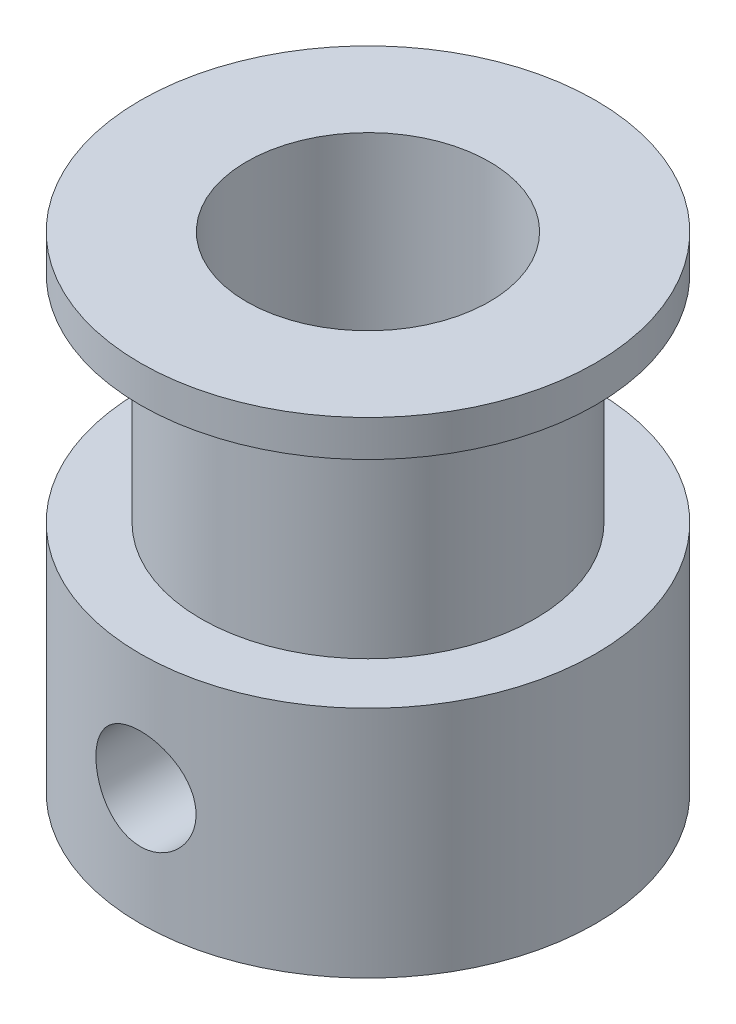
ISO-10303-21;
HEADER;
FILE_DESCRIPTION(('STEP AP214'),'2;1');
FILE_NAME('part.step','',(''),(''),'','','');
FILE_SCHEMA(('AUTOMOTIVE_DESIGN { 1 0 10303 214 1 1 1 1 }'));
ENDSEC;
DATA;
#1=APPLICATION_CONTEXT('core data for automotive mechanical design processes');
#2=APPLICATION_PROTOCOL_DEFINITION('international standard','automotive_design',2000,#1);
#3=PRODUCT_CONTEXT('',#1,'mechanical');
#4=PRODUCT('Part','Part','',(#3));
#5=PRODUCT_RELATED_PRODUCT_CATEGORY('part','',(#4));
#6=PRODUCT_DEFINITION_FORMATION('','',#4);
#7=PRODUCT_DEFINITION_CONTEXT('part definition',#1,'design');
#8=PRODUCT_DEFINITION('design','',#6,#7);
#9=PRODUCT_DEFINITION_SHAPE('','',#8);
#10=(LENGTH_UNIT() NAMED_UNIT(*) SI_UNIT(.MILLI.,.METRE.));
#11=(NAMED_UNIT(*) PLANE_ANGLE_UNIT() SI_UNIT($,.RADIAN.));
#12=(NAMED_UNIT(*) SI_UNIT($,.STERADIAN.) SOLID_ANGLE_UNIT());
#13=UNCERTAINTY_MEASURE_WITH_UNIT(LENGTH_MEASURE(1.E-05),#10,'distance_accuracy_value','');
#14=(GEOMETRIC_REPRESENTATION_CONTEXT(3) GLOBAL_UNCERTAINTY_ASSIGNED_CONTEXT((#13)) GLOBAL_UNIT_ASSIGNED_CONTEXT((#10,
#11,#12)) REPRESENTATION_CONTEXT('',''));
#15=CARTESIAN_POINT('',(0.,0.,0.));
#16=DIRECTION('',(0.,0.,1.));
#17=DIRECTION('',(1.,0.,0.));
#18=AXIS2_PLACEMENT_3D('',#15,#16,#17);
#19=CARTESIAN_POINT('',(0.,7.7,0.));
#20=DIRECTION('',(0.,1.,0.));
#21=DIRECTION('',(0.,0.,1.));
#22=AXIS2_PLACEMENT_3D('',#19,#20,#21);
#23=PLANE('',#22);
#24=CARTESIAN_POINT('',(0.,7.7,0.));
#25=DIRECTION('',(0.,1.,0.));
#26=DIRECTION('',(0.,0.,1.));
#27=AXIS2_PLACEMENT_3D('',#24,#25,#26);
#28=CIRCLE('',#27,7.5);
#29=CARTESIAN_POINT('',(0.,7.7,7.5));
#30=VERTEX_POINT('',#29);
#31=EDGE_CURVE('E10',#30,#30,#28,.T.);
#32=ORIENTED_EDGE('',*,*,#31,.T.);
#33=EDGE_LOOP('',(#32));
#34=FACE_BOUND('',#33,.T.);
#35=CARTESIAN_POINT('',(0.,7.7,0.));
#36=DIRECTION('',(0.,1.,0.));
#37=DIRECTION('',(0.,0.,1.));
#38=AXIS2_PLACEMENT_3D('',#35,#36,#37);
#39=CIRCLE('',#38,5.5);
#40=CARTESIAN_POINT('',(0.,7.7,5.5));
#41=VERTEX_POINT('',#40);
#42=EDGE_CURVE('E47',#41,#41,#39,.T.);
#43=ORIENTED_EDGE('',*,*,#42,.F.);
#44=EDGE_LOOP('',(#43));
#45=FACE_BOUND('',#44,.T.);
#46=ADVANCED_FACE('F34',(#34,#45),#23,.T.);
#47=CARTESIAN_POINT('',(0.,7.7,0.));
#48=DIRECTION('',(0.,-1.,0.));
#49=DIRECTION('',(0.,0.,-1.));
#50=AXIS2_PLACEMENT_3D('',#47,#48,#49);
#51=CYLINDRICAL_SURFACE('',#50,7.5);
#52=CARTESIAN_POINT('',(-7.31624903895431,3.85,-1.65000000000002));
#53=CARTESIAN_POINT('',(-7.31625088755515,3.94146973086409,-1.6499968723868));
#54=CARTESIAN_POINT('',(-7.31798309325128,4.03297693288286,-1.64236802798418));
#55=CARTESIAN_POINT('',(-7.32471183232318,4.21338806456882,-1.61208819446861));
#56=CARTESIAN_POINT('',(-7.32971070790264,4.30229007849127,-1.58942642656671));
#57=CARTESIAN_POINT('',(-7.34237985840046,4.47485502908709,-1.52982964328278));
#58=CARTESIAN_POINT('',(-7.35004718160979,4.55852363456255,-1.49291039391804));
#59=CARTESIAN_POINT('',(-7.36718575613813,4.7184815468929,-1.40589188591686));
#60=CARTESIAN_POINT('',(-7.37665697473834,4.79477098755221,-1.35579286632699));
#61=CARTESIAN_POINT('',(-7.3965170031272,4.93910974076173,-1.24292433856891));
#62=CARTESIAN_POINT('',(-7.40691766647597,5.00701458900787,-1.17997213988136));
#63=CARTESIAN_POINT('',(-7.42736095401493,5.13139107633494,-1.0435785816799));
#64=CARTESIAN_POINT('',(-7.4374035501214,5.18786182024078,-0.970136401673276));
#65=CARTESIAN_POINT('',(-7.45612834127545,5.28833929650793,-0.813878252361385));
#66=CARTESIAN_POINT('',(-7.46479491885843,5.33220696771727,-0.730970831126916));
#67=CARTESIAN_POINT('',(-7.47965723905511,5.40533320427458,-0.558738323735998));
#68=CARTESIAN_POINT('',(-7.48585326220645,5.4345934284299,-0.469413967598791));
#69=CARTESIAN_POINT('',(-7.49499258405706,5.4772194994386,-0.288385428255521));
#70=CARTESIAN_POINT('',(-7.49798587273974,5.49082987669094,-0.19674139004883));
#71=CARTESIAN_POINT('',(-7.50055570151691,5.50253456626563,-0.0124251616130323));
#72=CARTESIAN_POINT('',(-7.50013263686835,5.50063067352012,0.0802469084384781));
#73=CARTESIAN_POINT('',(-7.495955593825,5.48154274970476,0.262302467715047));
#74=CARTESIAN_POINT('',(-7.49225907708335,5.46462230565467,0.351715105755815));
#75=CARTESIAN_POINT('',(-7.48201600117218,5.41640176183781,0.526399853776861));
#76=CARTESIAN_POINT('',(-7.47546931215518,5.38510100693256,0.611671774918564));
#77=CARTESIAN_POINT('',(-7.4601692539791,5.30877597185231,0.776384814979645));
#78=CARTESIAN_POINT('',(-7.4513999396354,5.26365201347084,0.855778203030041));
#79=CARTESIAN_POINT('',(-7.43261578068531,5.16103585107844,1.0059618544021));
#80=CARTESIAN_POINT('',(-7.42260076463453,5.10354194381027,1.07675093086625));
#81=CARTESIAN_POINT('',(-7.40217730546681,4.9763837195204,1.20928438119746));
#82=CARTESIAN_POINT('',(-7.39176501831048,4.90648871816167,1.2708070306733));
#83=CARTESIAN_POINT('',(-7.37191784161863,4.75726574312354,1.38129938042402));
#84=CARTESIAN_POINT('',(-7.36248297921061,4.67793750776478,1.43026873234954));
#85=CARTESIAN_POINT('',(-7.34564860357408,4.51173851513502,1.51436459204096));
#86=CARTESIAN_POINT('',(-7.33825533607679,4.42484565931797,1.54944876044601));
#87=CARTESIAN_POINT('',(-7.32642749366314,4.24619629545267,1.60445002092191));
#88=CARTESIAN_POINT('',(-7.32199244335324,4.1544405714401,1.62436955006421));
#89=CARTESIAN_POINT('',(-7.31668025811922,3.97069723278599,1.64813125819885));
#90=CARTESIAN_POINT('',(-7.3157316460625,3.87875341120337,1.65229647649245));
#91=CARTESIAN_POINT('',(-7.31730686199935,3.69548511979447,1.64530629720021));
#92=CARTESIAN_POINT('',(-7.31983044843577,3.60416060732768,1.63415196537919));
#93=CARTESIAN_POINT('',(-7.32799818106293,3.42585095587481,1.59711971164377));
#94=CARTESIAN_POINT('',(-7.33360451240971,3.33882689194342,1.57142010132682));
#95=CARTESIAN_POINT('',(-7.34727186080226,3.17032002019244,1.50622005364928));
#96=CARTESIAN_POINT('',(-7.35533311504714,3.08883774876201,1.46671828264447));
#97=CARTESIAN_POINT('',(-7.3731587965039,2.93233060588287,1.37432488547162));
#98=CARTESIAN_POINT('',(-7.382947772276,2.85742593290676,1.32123448604816));
#99=CARTESIAN_POINT('',(-7.4030613604032,2.71747028808809,1.20343062618996));
#100=CARTESIAN_POINT('',(-7.41338603997543,2.65242055682212,1.13871570465473));
#101=CARTESIAN_POINT('',(-7.43364357465481,2.53276535480176,0.998037209735731));
#102=CARTESIAN_POINT('',(-7.44356535241184,2.4783802494884,0.921884336180632));
#103=CARTESIAN_POINT('',(-7.46169442992805,2.38317489882865,0.761336036824583));
#104=CARTESIAN_POINT('',(-7.46990181024338,2.34235401607305,0.676940998580206));
#105=CARTESIAN_POINT('',(-7.48363068143194,2.27574171059229,0.502832892211417));
#106=CARTESIAN_POINT('',(-7.48916925974756,2.2498544564071,0.413157897094201));
#107=CARTESIAN_POINT('',(-7.49701039926598,2.21354535667227,0.230596117157405));
#108=CARTESIAN_POINT('',(-7.49931343668317,2.20312123521036,0.137709807049009));
#109=CARTESIAN_POINT('',(-7.5004096608408,2.19813763024745,-0.0465467976169041));
#110=CARTESIAN_POINT('',(-7.49927560514944,2.20324928652386,-0.137907919239389));
#111=CARTESIAN_POINT('',(-7.49378116111434,2.22845586812367,-0.318434938549236));
#112=CARTESIAN_POINT('',(-7.48942083208781,2.24855051797476,-0.407600876565377));
#113=CARTESIAN_POINT('',(-7.47796938667334,2.30299430459218,-0.580948603319191));
#114=CARTESIAN_POINT('',(-7.47088730695872,2.33729629955119,-0.665145833031318));
#115=CARTESIAN_POINT('',(-7.45474818907577,2.41913529507116,-0.826633320628113));
#116=CARTESIAN_POINT('',(-7.44569095681539,2.46667359644966,-0.90392289866643));
#117=CARTESIAN_POINT('',(-7.42637227436533,2.57470542656565,-1.05100357132855));
#118=CARTESIAN_POINT('',(-7.41609106168948,2.6354299159513,-1.1206224429641));
#119=CARTESIAN_POINT('',(-7.39558892619984,2.76764517036168,-1.24879435055275));
#120=CARTESIAN_POINT('',(-7.38536801854032,2.83913853101667,-1.30734471095976));
#121=CARTESIAN_POINT('',(-7.36598909951959,2.9920282321614,-1.41248320884195));
#122=CARTESIAN_POINT('',(-7.35684738344025,3.0735457294591,-1.45889834183912));
#123=CARTESIAN_POINT('',(-7.34086729136659,3.24340812301069,-1.53729647396118));
#124=CARTESIAN_POINT('',(-7.33402697741116,3.33174719748978,-1.56929162359244));
#125=CARTESIAN_POINT('',(-7.32468149984519,3.49180640143421,-1.61226511938891));
#126=CARTESIAN_POINT('',(-7.3215404178438,3.56266180531771,-1.62638842605615));
#127=CARTESIAN_POINT('',(-7.31732350955713,3.70567040573683,-1.64525686645989));
#128=CARTESIAN_POINT('',(-7.31624758026991,3.77782353736554,-1.6500024679209));
#129=CARTESIAN_POINT('',(-7.31624903895431,3.85,-1.65000000000002));
#130=B_SPLINE_CURVE_WITH_KNOTS('',3,(#52,#53,#54,#55,#56,#57,#58,#59,#60,#61,#62,#63,#64,#65,
#66,#67,#68,#69,#70,#71,#72,#73,#74,#75,#76,#77,#78,#79,#80,#81,#82,#83,#84,#85,#86,#87,#88,#89,
#90,#91,#92,#93,#94,#95,#96,#97,#98,#99,#100,#101,#102,#103,#104,#105,#106,#107,#108,#109,#110,
#111,#112,#113,#114,#115,#116,#117,#118,#119,#120,#121,#122,#123,#124,#125,#126,#127,#128,#129),
.UNSPECIFIED.,.T.,.F.,(4,2,2,2,2,2,2,2,2,2,2,2,2,2,2,2,2,2,2,2,2,2,2,2,2,2,2,2,2,2,2,2,2,2,2,2,
2,2,4),(0.,0.274144651661673,0.548486081142453,0.822525006744839,1.09655896234066,
1.37479941240961,1.65306163748477,1.93428561187474,2.21547764347729,2.49221362033069,
2.76891758051511,3.04085852905802,3.31281186792031,3.58677434219925,3.86077456340393,
4.14054172785271,4.42031665489643,4.70093823069211,4.98151469896661,5.25630579423046,
5.5310777735383,5.8025520804998,6.07405262612899,6.34977751987123,6.62553709409573,
6.90650280685807,7.18745531462717,7.46658425375132,7.74567210572694,8.01889368789618,
8.29211024682832,8.56442740979039,8.83677134457515,9.11433803885878,9.39197174265346,
9.67337079196286,9.95453228463008,10.1708637200099,10.3871843653226),.UNSPECIFIED.);
#131=CARTESIAN_POINT('',(-7.31624903895431,3.85,-1.65000000000002));
#132=VERTEX_POINT('',#131);
#133=EDGE_CURVE('E91',#132,#132,#130,.T.);
#134=ORIENTED_EDGE('',*,*,#133,.T.);
#135=EDGE_LOOP('',(#134));
#136=FACE_BOUND('',#135,.T.);
#137=CARTESIAN_POINT('',(-1.65,3.85,7.31624903895432));
#138=CARTESIAN_POINT('',(-1.64999687238678,3.94146973086409,7.31625088755516));
#139=CARTESIAN_POINT('',(-1.64236802798416,4.03297693288286,7.31798309325129));
#140=CARTESIAN_POINT('',(-1.61208819446858,4.21338806456882,7.32471183232318));
#141=CARTESIAN_POINT('',(-1.58942642656669,4.30229007849127,7.32971070790265));
#142=CARTESIAN_POINT('',(-1.52982964328276,4.47485502908709,7.34237985840046));
#143=CARTESIAN_POINT('',(-1.49291039391801,4.55852363456255,7.3500471816098));
#144=CARTESIAN_POINT('',(-1.40589188591683,4.7184815468929,7.36718575613814));
#145=CARTESIAN_POINT('',(-1.35579286632696,4.79477098755221,7.37665697473834));
#146=CARTESIAN_POINT('',(-1.24292433856889,4.93910974076172,7.39651700312721));
#147=CARTESIAN_POINT('',(-1.17997213988133,5.00701458900787,7.40691766647597));
#148=CARTESIAN_POINT('',(-1.04357858167987,5.13139107633494,7.42736095401494));
#149=CARTESIAN_POINT('',(-0.97013640167325,5.18786182024078,7.43740355012141));
#150=CARTESIAN_POINT('',(-0.81387825236136,5.28833929650793,7.45612834127545));
#151=CARTESIAN_POINT('',(-0.73097083112689,5.33220696771727,7.46479491885843));
#152=CARTESIAN_POINT('',(-0.558738323735973,5.40533320427458,7.47965723905511));
#153=CARTESIAN_POINT('',(-0.469413967598766,5.4345934284299,7.48585326220645));
#154=CARTESIAN_POINT('',(-0.288385428255495,5.4772194994386,7.49499258405706));
#155=CARTESIAN_POINT('',(-0.196741390048804,5.49082987669094,7.49798587273975));
#156=CARTESIAN_POINT('',(-0.012425161613006,5.50253456626563,7.50055570151691));
#157=CARTESIAN_POINT('',(0.0802469084385042,5.50063067352012,7.50013263686835));
#158=CARTESIAN_POINT('',(0.262302467715074,5.48154274970476,7.495955593825));
#159=CARTESIAN_POINT('',(0.351715105755841,5.46462230565467,7.49225907708335));
#160=CARTESIAN_POINT('',(0.526399853776888,5.41640176183781,7.48201600117218));
#161=CARTESIAN_POINT('',(0.61167177491859,5.38510100693256,7.47546931215517));
#162=CARTESIAN_POINT('',(0.776384814979671,5.30877597185231,7.4601692539791));
#163=CARTESIAN_POINT('',(0.855778203030067,5.26365201347084,7.4513999396354));
#164=CARTESIAN_POINT('',(1.00596185440213,5.16103585107844,7.43261578068531));
#165=CARTESIAN_POINT('',(1.07675093086628,5.10354194381027,7.42260076463452));
#166=CARTESIAN_POINT('',(1.20928438119749,4.9763837195204,7.4021773054668));
#167=CARTESIAN_POINT('',(1.27080703067333,4.90648871816167,7.39176501831048));
#168=CARTESIAN_POINT('',(1.38129938042404,4.75726574312354,7.37191784161863));
#169=CARTESIAN_POINT('',(1.43026873234956,4.67793750776478,7.36248297921061));
#170=CARTESIAN_POINT('',(1.51436459204098,4.51173851513502,7.34564860357408));
#171=CARTESIAN_POINT('',(1.54944876044604,4.42484565931797,7.33825533607679));
#172=CARTESIAN_POINT('',(1.60445002092193,4.24619629545267,7.32642749366313));
#173=CARTESIAN_POINT('',(1.62436955006424,4.1544405714401,7.32199244335324));
#174=CARTESIAN_POINT('',(1.64813125819888,3.97069723278599,7.31668025811921));
#175=CARTESIAN_POINT('',(1.65229647649247,3.87875341120337,7.31573164606249));
#176=CARTESIAN_POINT('',(1.64530629720023,3.69548511979447,7.31730686199934));
#177=CARTESIAN_POINT('',(1.63415196537921,3.60416060732768,7.31983044843577));
#178=CARTESIAN_POINT('',(1.59711971164379,3.4258509558748,7.32799818106292));
#179=CARTESIAN_POINT('',(1.57142010132685,3.33882689194341,7.33360451240971));
#180=CARTESIAN_POINT('',(1.50622005364931,3.17032002019244,7.34727186080226));
#181=CARTESIAN_POINT('',(1.4667182826445,3.08883774876201,7.35533311504714));
#182=CARTESIAN_POINT('',(1.37432488547164,2.93233060588287,7.37315879650389));
#183=CARTESIAN_POINT('',(1.32123448604819,2.85742593290676,7.38294777227599));
#184=CARTESIAN_POINT('',(1.20343062618998,2.71747028808809,7.4030613604032));
#185=CARTESIAN_POINT('',(1.13871570465475,2.65242055682212,7.41338603997542));
#186=CARTESIAN_POINT('',(0.998037209735757,2.53276535480176,7.43364357465481));
#187=CARTESIAN_POINT('',(0.921884336180657,2.4783802494884,7.44356535241183));
#188=CARTESIAN_POINT('',(0.761336036824609,2.38317489882865,7.46169442992805));
#189=CARTESIAN_POINT('',(0.676940998580232,2.34235401607305,7.46990181024338));
#190=CARTESIAN_POINT('',(0.502832892211442,2.27574171059229,7.48363068143194));
#191=CARTESIAN_POINT('',(0.413157897094227,2.2498544564071,7.48916925974756));
#192=CARTESIAN_POINT('',(0.230596117157431,2.21354535667227,7.49701039926598));
#193=CARTESIAN_POINT('',(0.137709807049034,2.20312123521036,7.49931343668317));
#194=CARTESIAN_POINT('',(-0.0465467976168785,2.19813763024745,7.5004096608408));
#195=CARTESIAN_POINT('',(-0.137907919239363,2.20324928652386,7.49927560514944));
#196=CARTESIAN_POINT('',(-0.31843493854921,2.22845586812367,7.49378116111434));
#197=CARTESIAN_POINT('',(-0.407600876565352,2.24855051797476,7.48942083208781));
#198=CARTESIAN_POINT('',(-0.580948603319166,2.30299430459218,7.47796938667334));
#199=CARTESIAN_POINT('',(-0.665145833031293,2.33729629955119,7.47088730695872));
#200=CARTESIAN_POINT('',(-0.826633320628087,2.41913529507116,7.45474818907578));
#201=CARTESIAN_POINT('',(-0.903922898666404,2.46667359644966,7.44569095681539));
#202=CARTESIAN_POINT('',(-1.05100357132852,2.57470542656565,7.42637227436533));
#203=CARTESIAN_POINT('',(-1.12062244296407,2.6354299159513,7.41609106168948));
#204=CARTESIAN_POINT('',(-1.24879435055272,2.76764517036168,7.39558892619985));
#205=CARTESIAN_POINT('',(-1.30734471095974,2.83913853101667,7.38536801854032));
#206=CARTESIAN_POINT('',(-1.41248320884192,2.9920282321614,7.36598909951959));
#207=CARTESIAN_POINT('',(-1.4588983418391,3.0735457294591,7.35684738344025));
#208=CARTESIAN_POINT('',(-1.53729647396116,3.24340812301069,7.34086729136659));
#209=CARTESIAN_POINT('',(-1.56929162359241,3.33174719748978,7.33402697741117));
#210=CARTESIAN_POINT('',(-1.61226511938889,3.49180640143421,7.3246814998452));
#211=CARTESIAN_POINT('',(-1.62638842605612,3.56266180531771,7.32154041784381));
#212=CARTESIAN_POINT('',(-1.64525686645986,3.70567040573683,7.31732350955714));
#213=CARTESIAN_POINT('',(-1.65000246792088,3.77782353736554,7.31624758026992));
#214=CARTESIAN_POINT('',(-1.65,3.85,7.31624903895432));
#215=B_SPLINE_CURVE_WITH_KNOTS('',3,(#137,#138,#139,#140,#141,#142,#143,#144,#145,#146,#147,
#148,#149,#150,#151,#152,#153,#154,#155,#156,#157,#158,#159,#160,#161,#162,#163,#164,#165,#166,
#167,#168,#169,#170,#171,#172,#173,#174,#175,#176,#177,#178,#179,#180,#181,#182,#183,#184,#185,
#186,#187,#188,#189,#190,#191,#192,#193,#194,#195,#196,#197,#198,#199,#200,#201,#202,#203,#204,
#205,#206,#207,#208,#209,#210,#211,#212,#213,#214),.UNSPECIFIED.,.T.,.F.,(4,2,2,2,2,2,2,2,2,2,2,
2,2,2,2,2,2,2,2,2,2,2,2,2,2,2,2,2,2,2,2,2,2,2,2,2,2,2,4),(0.,0.274144651661673,
0.548486081142454,0.822525006744839,1.09655896234066,1.37479941240961,1.65306163748477,
1.93428561187474,2.21547764347729,2.49221362033069,2.76891758051511,3.04085852905802,
3.31281186792031,3.58677434219925,3.86077456340393,4.14054172785271,4.42031665489642,
4.70093823069211,4.98151469896661,5.25630579423046,5.5310777735383,5.8025520804998,
6.07405262612899,6.34977751987123,6.62553709409573,6.90650280685807,7.18745531462717,
7.46658425375132,7.74567210572694,8.01889368789618,8.29211024682833,8.56442740979039,
8.83677134457515,9.11433803885878,9.39197174265346,9.67337079196286,9.95453228463008,
10.1708637200099,10.3871843653226),.UNSPECIFIED.);
#216=CARTESIAN_POINT('',(-1.65,3.85,7.31624903895432));
#217=VERTEX_POINT('',#216);
#218=EDGE_CURVE('E71',#217,#217,#215,.T.);
#219=ORIENTED_EDGE('',*,*,#218,.T.);
#220=EDGE_LOOP('',(#219));
#221=FACE_BOUND('',#220,.T.);
#222=ORIENTED_EDGE('',*,*,#31,.F.);
#223=EDGE_LOOP('',(#222));
#224=FACE_BOUND('',#223,.T.);
#225=CARTESIAN_POINT('',(0.,0.,0.));
#226=DIRECTION('',(0.,1.,0.));
#227=DIRECTION('',(0.,0.,1.));
#228=AXIS2_PLACEMENT_3D('',#225,#226,#227);
#229=CIRCLE('',#228,7.5);
#230=CARTESIAN_POINT('',(0.,0.,7.5));
#231=VERTEX_POINT('',#230);
#232=EDGE_CURVE('E38',#231,#231,#229,.T.);
#233=ORIENTED_EDGE('',*,*,#232,.T.);
#234=EDGE_LOOP('',(#233));
#235=FACE_BOUND('',#234,.T.);
#236=ADVANCED_FACE('F36',(#136,#221,#224,#235),#51,.T.);
#237=CARTESIAN_POINT('',(0.,0.,0.));
#238=DIRECTION('',(0.,1.,0.));
#239=DIRECTION('',(0.,0.,1.));
#240=AXIS2_PLACEMENT_3D('',#237,#238,#239);
#241=PLANE('',#240);
#242=CARTESIAN_POINT('',(0.,0.,0.));
#243=DIRECTION('',(0.,1.,0.));
#244=DIRECTION('',(0.,0.,1.));
#245=AXIS2_PLACEMENT_3D('',#242,#243,#244);
#246=CIRCLE('',#245,4.);
#247=CARTESIAN_POINT('',(0.,0.,4.));
#248=VERTEX_POINT('',#247);
#249=EDGE_CURVE('E56',#248,#248,#246,.T.);
#250=ORIENTED_EDGE('',*,*,#249,.T.);
#251=EDGE_LOOP('',(#250));
#252=FACE_BOUND('',#251,.T.);
#253=ORIENTED_EDGE('',*,*,#232,.F.);
#254=EDGE_LOOP('',(#253));
#255=FACE_BOUND('',#254,.T.);
#256=ADVANCED_FACE('F134',(#252,#255),#241,.F.);
#257=CARTESIAN_POINT('',(0.,14.8,0.));
#258=DIRECTION('',(0.,-1.,0.));
#259=DIRECTION('',(0.,0.,-1.));
#260=AXIS2_PLACEMENT_3D('',#257,#258,#259);
#261=CYLINDRICAL_SURFACE('',#260,5.5);
#262=CARTESIAN_POINT('',(0.,14.8,0.));
#263=DIRECTION('',(0.,1.,0.));
#264=DIRECTION('',(0.,0.,1.));
#265=AXIS2_PLACEMENT_3D('',#262,#263,#264);
#266=CIRCLE('',#265,5.5);
#267=CARTESIAN_POINT('',(0.,14.8,5.5));
#268=VERTEX_POINT('',#267);
#269=EDGE_CURVE('E45',#268,#268,#266,.T.);
#270=ORIENTED_EDGE('',*,*,#269,.F.);
#271=EDGE_LOOP('',(#270));
#272=FACE_BOUND('',#271,.T.);
#273=ORIENTED_EDGE('',*,*,#42,.T.);
#274=EDGE_LOOP('',(#273));
#275=FACE_BOUND('',#274,.T.);
#276=ADVANCED_FACE('F128',(#272,#275),#261,.T.);
#277=CARTESIAN_POINT('',(0.,14.8,0.));
#278=DIRECTION('',(0.,1.,0.));
#279=DIRECTION('',(0.,0.,1.));
#280=AXIS2_PLACEMENT_3D('',#277,#278,#279);
#281=PLANE('',#280);
#282=CARTESIAN_POINT('',(0.,14.8,0.));
#283=DIRECTION('',(0.,1.,0.));
#284=DIRECTION('',(0.,0.,1.));
#285=AXIS2_PLACEMENT_3D('',#282,#283,#284);
#286=CIRCLE('',#285,7.5);
#287=CARTESIAN_POINT('',(0.,14.8,7.5));
#288=VERTEX_POINT('',#287);
#289=EDGE_CURVE('E53',#288,#288,#286,.T.);
#290=ORIENTED_EDGE('',*,*,#289,.F.);
#291=EDGE_LOOP('',(#290));
#292=FACE_BOUND('',#291,.T.);
#293=ORIENTED_EDGE('',*,*,#269,.T.);
#294=EDGE_LOOP('',(#293));
#295=FACE_BOUND('',#294,.T.);
#296=ADVANCED_FACE('F122',(#292,#295),#281,.F.);
#297=CARTESIAN_POINT('',(0.,16.,0.));
#298=DIRECTION('',(0.,-1.,0.));
#299=DIRECTION('',(0.,0.,-1.));
#300=AXIS2_PLACEMENT_3D('',#297,#298,#299);
#301=CYLINDRICAL_SURFACE('',#300,7.5);
#302=CARTESIAN_POINT('',(0.,16.,0.));
#303=DIRECTION('',(0.,1.,0.));
#304=DIRECTION('',(0.,0.,1.));
#305=AXIS2_PLACEMENT_3D('',#302,#303,#304);
#306=CIRCLE('',#305,7.5);
#307=CARTESIAN_POINT('',(0.,16.,7.5));
#308=VERTEX_POINT('',#307);
#309=EDGE_CURVE('E50',#308,#308,#306,.T.);
#310=ORIENTED_EDGE('',*,*,#309,.F.);
#311=EDGE_LOOP('',(#310));
#312=FACE_BOUND('',#311,.T.);
#313=ORIENTED_EDGE('',*,*,#289,.T.);
#314=EDGE_LOOP('',(#313));
#315=FACE_BOUND('',#314,.T.);
#316=ADVANCED_FACE('F117',(#312,#315),#301,.T.);
#317=CARTESIAN_POINT('',(0.,16.,0.));
#318=DIRECTION('',(0.,1.,0.));
#319=DIRECTION('',(0.,0.,1.));
#320=AXIS2_PLACEMENT_3D('',#317,#318,#319);
#321=PLANE('',#320);
#322=CARTESIAN_POINT('',(0.,16.,0.));
#323=DIRECTION('',(0.,1.,0.));
#324=DIRECTION('',(0.,0.,1.));
#325=AXIS2_PLACEMENT_3D('',#322,#323,#324);
#326=CIRCLE('',#325,4.);
#327=CARTESIAN_POINT('',(0.,16.,4.));
#328=VERTEX_POINT('',#327);
#329=EDGE_CURVE('E59',#328,#328,#326,.T.);
#330=ORIENTED_EDGE('',*,*,#329,.F.);
#331=EDGE_LOOP('',(#330));
#332=FACE_BOUND('',#331,.T.);
#333=ORIENTED_EDGE('',*,*,#309,.T.);
#334=EDGE_LOOP('',(#333));
#335=FACE_BOUND('',#334,.T.);
#336=ADVANCED_FACE('F110',(#332,#335),#321,.T.);
#337=CARTESIAN_POINT('',(0.,0.,0.));
#338=DIRECTION('',(0.,1.,0.));
#339=DIRECTION('',(0.,0.,1.));
#340=AXIS2_PLACEMENT_3D('',#337,#338,#339);
#341=CYLINDRICAL_SURFACE('',#340,4.);
#342=CARTESIAN_POINT('',(-3.6438304022004,3.85,-1.65000000000001));
#343=CARTESIAN_POINT('',(-3.64383945275152,3.76190351977432,-1.64999056813103));
#344=CARTESIAN_POINT('',(-3.64707173267573,3.67365956802641,-1.64289989177359));
#345=CARTESIAN_POINT('',(-3.65959209124687,3.49971293892112,-1.61480845546374));
#346=CARTESIAN_POINT('',(-3.66889676295874,3.4140178994024,-1.59376957896341));
#347=CARTESIAN_POINT('',(-3.69231325052125,3.24799706186937,-1.53873536249639));
#348=CARTESIAN_POINT('',(-3.70640571161011,3.1676511797814,-1.50479212400175));
#349=CARTESIAN_POINT('',(-3.73778230052356,3.01381823316578,-1.42506535594208));
#350=CARTESIAN_POINT('',(-3.75506562873472,2.94032945721597,-1.37928479159597));
#351=CARTESIAN_POINT('',(-3.7920553041855,2.7977713121535,-1.27419856290373));
#352=CARTESIAN_POINT('',(-3.81184277704779,2.72917074421979,-1.21428518241361));
#353=CARTESIAN_POINT('',(-3.85094363418237,2.60264522809124,-1.08391072165484));
#354=CARTESIAN_POINT('',(-3.87025683535296,2.54472434852778,-1.01344563996366));
#355=CARTESIAN_POINT('',(-3.90721575035942,2.43882862869814,-0.860301943593394));
#356=CARTESIAN_POINT('',(-3.92475616703247,2.39137906729384,-0.777232390113603));
#357=CARTESIAN_POINT('',(-3.95520283117798,2.3113298546783,-0.603436361875869));
#358=CARTESIAN_POINT('',(-3.96811109652272,2.27872373565344,-0.512713242513057));
#359=CARTESIAN_POINT('',(-3.98726403378776,2.23097929334377,-0.331105172304411));
#360=CARTESIAN_POINT('',(-3.99381564337609,2.21503315207677,-0.240465625184505));
#361=CARTESIAN_POINT('',(-4.0006306156112,2.19845334814483,-0.0575763551498782));
#362=CARTESIAN_POINT('',(-4.00089647540932,2.19781360467799,0.0346727137709422));
#363=CARTESIAN_POINT('',(-3.99529224160632,2.2114364961366,0.212297380895972));
#364=CARTESIAN_POINT('',(-3.98978733384659,2.2248121837171,0.297754665400384));
#365=CARTESIAN_POINT('',(-3.97375926025945,2.26456881744776,0.465085845235266));
#366=CARTESIAN_POINT('',(-3.96323572489496,2.29095072129068,0.546959476205479));
#367=CARTESIAN_POINT('',(-3.93798907731603,2.35628766172018,0.706295606817216));
#368=CARTESIAN_POINT('',(-3.92320447216363,2.39542798992487,0.783671979762457));
#369=CARTESIAN_POINT('',(-3.89088763760773,2.4849912791866,0.930960489992453));
#370=CARTESIAN_POINT('',(-3.87335444442337,2.53541820050331,1.00086999453931));
#371=CARTESIAN_POINT('',(-3.83587133640027,2.65018823902864,1.13638530947039));
#372=CARTESIAN_POINT('',(-3.8158381454309,2.71525341089872,1.20135746318644));
#373=CARTESIAN_POINT('',(-3.77653142784556,2.85540966632157,1.31973838423492));
#374=CARTESIAN_POINT('',(-3.75725818494773,2.9305044492633,1.37314286572201));
#375=CARTESIAN_POINT('',(-3.7210660715691,3.09159840354731,1.46845339844827));
#376=CARTESIAN_POINT('',(-3.70424107982558,3.17786757169265,1.50994179309275));
#377=CARTESIAN_POINT('',(-3.67596385006486,3.3570466714059,1.57754508127094));
#378=CARTESIAN_POINT('',(-3.66450786071418,3.44995191387382,1.6036707120612));
#379=CARTESIAN_POINT('',(-3.64919091711419,3.63342289518498,1.6382132035594));
#380=CARTESIAN_POINT('',(-3.64489111171832,3.72375830118286,1.6476556945468));
#381=CARTESIAN_POINT('',(-3.64311980380968,3.9048056296986,1.65157101672825));
#382=CARTESIAN_POINT('',(-3.6456460160745,3.99551741605928,1.646048857804));
#383=CARTESIAN_POINT('',(-3.65678944366162,4.16880100904947,1.62112710501825));
#384=CARTESIAN_POINT('',(-3.66501803861665,4.25152817967461,1.60261202118541));
#385=CARTESIAN_POINT('',(-3.68614612916708,4.41263706437997,1.55339580262014));
#386=CARTESIAN_POINT('',(-3.69904670212357,4.49101777135166,1.52269185697122));
#387=CARTESIAN_POINT('',(-3.72872477858183,4.64487900569564,1.44853902204984));
#388=CARTESIAN_POINT('',(-3.74564214050946,4.72010019477924,1.40460979308263));
#389=CARTESIAN_POINT('',(-3.78124523189864,4.86246016942973,1.3057345540945));
#390=CARTESIAN_POINT('',(-3.79993171387674,4.92959548773512,1.25078384473682));
#391=CARTESIAN_POINT('',(-3.83876011670653,5.05942962644671,1.12627542162097));
#392=CARTESIAN_POINT('',(-3.85889967217623,5.12135173704872,1.05590387126703));
#393=CARTESIAN_POINT('',(-3.89698114804694,5.23264285566207,0.905297980080091));
#394=CARTESIAN_POINT('',(-3.91492292631237,5.2820110520032,0.825063002026891));
#395=CARTESIAN_POINT('',(-3.94668767391886,5.36670413420679,0.656516816883255));
#396=CARTESIAN_POINT('',(-3.96050313975064,5.40200347500273,0.568191273870479));
#397=CARTESIAN_POINT('',(-3.98237104121022,5.45699165685874,0.386140833605164));
#398=CARTESIAN_POINT('',(-3.9904268305481,5.47668958293894,0.292419112817548));
#399=CARTESIAN_POINT('',(-3.9994889299446,5.49878822892048,0.109187189544823));
#400=CARTESIAN_POINT('',(-4.00094173424749,5.50228482874194,0.0198303081186226));
#401=CARTESIAN_POINT('',(-3.99786220239438,5.49481456562972,-0.158161739195425));
#402=CARTESIAN_POINT('',(-3.99333087896147,5.48385015000455,-0.246797024648493));
#403=CARTESIAN_POINT('',(-3.979024148364,5.44855535786444,-0.417705375935889));
#404=CARTESIAN_POINT('',(-3.96943363922013,5.42469555788545,-0.500092371627864));
#405=CARTESIAN_POINT('',(-3.94605480923815,5.36479588512001,-0.659667355734173));
#406=CARTESIAN_POINT('',(-3.93226568297162,5.32875367521332,-0.736854343148757));
#407=CARTESIAN_POINT('',(-3.90105808483759,5.24369547331361,-0.887661133732631));
#408=CARTESIAN_POINT('',(-3.88350423911689,5.19416874322707,-0.960964214361162));
#409=CARTESIAN_POINT('',(-3.84685709666619,5.08429715321,-1.09852932170706));
#410=CARTESIAN_POINT('',(-3.82776324400832,5.02394837691919,-1.16278806031651));
#411=CARTESIAN_POINT('',(-3.78859741195737,4.88941247264534,-1.28487769945048));
#412=CARTESIAN_POINT('',(-3.76854475207571,4.81457224311506,-1.34199767947158));
#413=CARTESIAN_POINT('',(-3.73105419200533,4.65573402431894,-1.44296474677331));
#414=CARTESIAN_POINT('',(-3.71361773967119,4.57173100829041,-1.48680449811905));
#415=CARTESIAN_POINT('',(-3.68370387904712,4.39727155873011,-1.55944447766653));
#416=CARTESIAN_POINT('',(-3.67119480418033,4.3068608919089,-1.58834112875235));
#417=CARTESIAN_POINT('',(-3.65281837075146,4.12195285592164,-1.63017263567574));
#418=CARTESIAN_POINT('',(-3.64692873900431,4.02747030912313,-1.64316103312976));
#419=CARTESIAN_POINT('',(-3.64414054419779,3.90513668635736,-1.64931209329421));
#420=CARTESIAN_POINT('',(-3.64382756923722,3.87757556771498,-1.65000295232161));
#421=CARTESIAN_POINT('',(-3.6438304022004,3.85,-1.65000000000001));
#422=B_SPLINE_CURVE_WITH_KNOTS('',3,(#342,#343,#344,#345,#346,#347,#348,#349,#350,#351,#352,
#353,#354,#355,#356,#357,#358,#359,#360,#361,#362,#363,#364,#365,#366,#367,#368,#369,#370,#371,
#372,#373,#374,#375,#376,#377,#378,#379,#380,#381,#382,#383,#384,#385,#386,#387,#388,#389,#390,
#391,#392,#393,#394,#395,#396,#397,#398,#399,#400,#401,#402,#403,#404,#405,#406,#407,#408,#409,
#410,#411,#412,#413,#414,#415,#416,#417,#418,#419,#420,#421),.UNSPECIFIED.,.T.,.F.,(4,2,2,2,2,2,
2,2,2,2,2,2,2,2,2,2,2,2,2,2,2,2,2,2,2,2,2,2,2,2,2,2,2,2,2,2,2,2,2,4),(0.,0.264211724660744,
0.529148459018597,0.793026677872048,1.05683885985756,1.33523297260792,1.61373292676209,
1.90403076094908,2.19420198072699,2.4695381624427,2.74476495901024,3.00356896819766,
3.26239203686791,3.5251552692474,3.78801084539545,4.06907613148064,4.35024537535724,
4.64031806272423,4.9301877724111,5.20152035698263,5.47276211576042,5.72713321026166,
5.9815630002888,6.24665916965708,6.51186861189123,6.79815687284346,7.08446363898863,
7.3712879145617,7.6579450434915,7.92489841526079,8.19180661499935,8.44957452423759,
8.70739191275388,8.97680852354694,9.24632283025306,9.53374725602175,9.82133016535515,
10.1070334851925,10.3917725616094,10.4744749384332),.UNSPECIFIED.);
#423=CARTESIAN_POINT('',(-3.6438304022004,3.85,-1.65000000000001));
#424=VERTEX_POINT('',#423);
#425=EDGE_CURVE('E95',#424,#424,#422,.T.);
#426=ORIENTED_EDGE('',*,*,#425,.T.);
#427=EDGE_LOOP('',(#426));
#428=FACE_BOUND('',#427,.T.);
#429=CARTESIAN_POINT('',(0.,2.2,4.));
#430=CARTESIAN_POINT('',(0.0884596783632789,2.20000921720663,3.99999309817074));
#431=CARTESIAN_POINT('',(0.177062252057582,2.20715601434332,3.99703145792172));
#432=CARTESIAN_POINT('',(0.351759669836409,2.2354911419369,3.9854711320255));
#433=CARTESIAN_POINT('',(0.437847271996961,2.25671651102432,3.97685757767606));
#434=CARTESIAN_POINT('',(0.604702496902741,2.31229481220189,3.95491965529936));
#435=CARTESIAN_POINT('',(0.685486934491196,2.34660364335346,3.94161112398211));
#436=CARTESIAN_POINT('',(0.840076633223487,2.42719475784943,3.91158286286531));
#437=CARTESIAN_POINT('',(0.913884076117566,2.47347328117016,3.89486420463244));
#438=CARTESIAN_POINT('',(1.05618769598525,2.57910675464405,3.85876900012149));
#439=CARTESIAN_POINT('',(1.12429373957476,2.63895767024897,3.83930654387258));
#440=CARTESIAN_POINT('',(1.24983574384757,2.76898883965897,3.80029483347099));
#441=CARTESIAN_POINT('',(1.30726618926957,2.83917439921181,3.78074553976622));
#442=CARTESIAN_POINT('',(1.41254826809049,2.99196824887171,3.74272551686067));
#443=CARTESIAN_POINT('',(1.45980781790561,3.07501111530652,3.72435159658093));
#444=CARTESIAN_POINT('',(1.53951358199407,3.24873630929018,3.69212136090386));
#445=CARTESIAN_POINT('',(1.57196727712791,3.33941475136301,3.67826276509115));
#446=CARTESIAN_POINT('',(1.61953738222492,3.52134799700183,3.65756021871623));
#447=CARTESIAN_POINT('',(1.63540371417154,3.61237107214307,3.65041449103236));
#448=CARTESIAN_POINT('',(1.65168918120803,3.79604650736528,3.64307714795703));
#449=CARTESIAN_POINT('',(1.65211659474,3.8886979676293,3.64288180572738));
#450=CARTESIAN_POINT('',(1.6380778077983,4.06559888661872,3.64921138579605));
#451=CARTESIAN_POINT('',(1.62472398487459,4.14995815874916,3.6552343974104));
#452=CARTESIAN_POINT('',(1.58536484231198,4.31511028438117,3.67247532251837));
#453=CARTESIAN_POINT('',(1.55935715587185,4.3959024676033,3.68369420783859));
#454=CARTESIAN_POINT('',(1.49492412942489,4.55364510875862,3.71031458481431));
#455=CARTESIAN_POINT('',(1.45624866973017,4.63047873780833,3.72579923184191));
#456=CARTESIAN_POINT('',(1.36775445443624,4.77686023246004,3.75918616236907));
#457=CARTESIAN_POINT('',(1.31793135478159,4.84640524224915,3.77708938726885));
#458=CARTESIAN_POINT('',(1.20371911924869,4.98228640778782,3.81509742396095));
#459=CARTESIAN_POINT('',(1.13846630094389,5.04788195770326,3.8352618825369));
#460=CARTESIAN_POINT('',(0.997682554866215,5.16744467444138,3.87426910607353));
#461=CARTESIAN_POINT('',(0.922149319847433,5.22140922386084,3.8931115728953));
#462=CARTESIAN_POINT('',(0.760736369737324,5.31723477358504,3.92787932271737));
#463=CARTESIAN_POINT('',(0.674664094072236,5.35880028319418,3.94373050716791));
#464=CARTESIAN_POINT('',(0.495928253552976,5.42660302410888,3.97016319816605));
#465=CARTESIAN_POINT('',(0.403268287372385,5.45284855321117,3.98074755693754));
#466=CARTESIAN_POINT('',(0.220181304317673,5.48772950367822,3.99492450637935));
#467=CARTESIAN_POINT('',(0.129974172308222,5.49735917793594,3.99891121146315));
#468=CARTESIAN_POINT('',(-0.0508474401522223,5.5016920437633,4.00069746426785));
#469=CARTESIAN_POINT('',(-0.141461799500566,5.49639941310822,3.99849874371343));
#470=CARTESIAN_POINT('',(-0.315907755487548,5.47175473175705,3.98841747083847));
#471=CARTESIAN_POINT('',(-0.399855317526685,5.45309592665991,3.9808153168881));
#472=CARTESIAN_POINT('',(-0.563340473329575,5.40320790366289,3.96098887803091));
#473=CARTESIAN_POINT('',(-0.642877505872146,5.37197709018521,3.94876400644332));
#474=CARTESIAN_POINT('',(-0.798061975964475,5.29681062001911,3.92039728883464));
#475=CARTESIAN_POINT('',(-0.873512656660507,5.25251143824379,3.90414585630856));
#476=CARTESIAN_POINT('',(-1.01617847320907,5.15286606574214,3.86946768187548));
#477=CARTESIAN_POINT('',(-1.0833901834211,5.09751530491017,3.85104004134398));
#478=CARTESIAN_POINT('',(-1.21261994292741,4.97279569518803,3.8124029584454));
#479=CARTESIAN_POINT('',(-1.27394364561822,4.9027161759607,3.79215916493832));
#480=CARTESIAN_POINT('',(-1.38414835482505,4.75292870939147,3.7533392894083));
#481=CARTESIAN_POINT('',(-1.43302674162727,4.67321874005745,3.73476355904109));
#482=CARTESIAN_POINT('',(-1.51742282291388,4.50490462946669,3.70128700339843));
#483=CARTESIAN_POINT('',(-1.55275802936534,4.41619808399194,3.68643724424496));
#484=CARTESIAN_POINT('',(-1.60769618165394,4.23329083402176,3.66281640168181));
#485=CARTESIAN_POINT('',(-1.62731175174753,4.13909460358183,3.65404044124936));
#486=CARTESIAN_POINT('',(-1.64901123940268,3.95556972684194,3.64429559365239));
#487=CARTESIAN_POINT('',(-1.65231049364125,3.86641278054206,3.64278573581523));
#488=CARTESIAN_POINT('',(-1.64451485356567,3.68887152924082,3.64631178238903));
#489=CARTESIAN_POINT('',(-1.6334220656173,3.60048711308063,3.65134672892696));
#490=CARTESIAN_POINT('',(-1.59817118006572,3.4310669287423,3.666904904187));
#491=CARTESIAN_POINT('',(-1.57461958437454,3.34987928857789,3.67717261200251));
#492=CARTESIAN_POINT('',(-1.51570599472927,3.19258547752592,3.70184411206584));
#493=CARTESIAN_POINT('',(-1.48034069596893,3.11648073570239,3.7162490615217));
#494=CARTESIAN_POINT('',(-1.3963806225379,2.9665779617586,3.7486340889516));
#495=CARTESIAN_POINT('',(-1.34712443599271,2.89318592897859,3.76677577854003));
#496=CARTESIAN_POINT('',(-1.23771718137822,2.75532831273572,3.80412864636709));
#497=CARTESIAN_POINT('',(-1.17756245772962,2.69086573722558,3.82334018195056));
#498=CARTESIAN_POINT('',(-1.04300738755744,2.56800586129633,3.86230172013188));
#499=CARTESIAN_POINT('',(-0.967900110730177,2.51036077639447,3.88199359359226));
#500=CARTESIAN_POINT('',(-0.808343463182034,2.40845984046128,3.91832426905579));
#501=CARTESIAN_POINT('',(-0.723889843442851,2.36421011363411,3.9349616732268));
#502=CARTESIAN_POINT('',(-0.549414760109628,2.29133626016526,3.96305691394126));
#503=CARTESIAN_POINT('',(-0.459513381649425,2.26245757464145,3.97459855421812));
#504=CARTESIAN_POINT('',(-0.275719229213241,2.22048891521486,3.99154438775475));
#505=CARTESIAN_POINT('',(-0.181839966818029,2.20734933375455,3.99696786149576));
#506=CARTESIAN_POINT('',(-0.0584442952271964,2.20077322966996,3.99968194626838));
#507=CARTESIAN_POINT('',(-0.029229948670338,2.19999695433579,4.00000228058838));
#508=CARTESIAN_POINT('',(0.,2.2,4.));
#509=B_SPLINE_CURVE_WITH_KNOTS('',3,(#429,#430,#431,#432,#433,#434,#435,#436,#437,#438,#439,
#440,#441,#442,#443,#444,#445,#446,#447,#448,#449,#450,#451,#452,#453,#454,#455,#456,#457,#458,
#459,#460,#461,#462,#463,#464,#465,#466,#467,#468,#469,#470,#471,#472,#473,#474,#475,#476,#477,
#478,#479,#480,#481,#482,#483,#484,#485,#486,#487,#488,#489,#490,#491,#492,#493,#494,#495,#496,
#497,#498,#499,#500,#501,#502,#503,#504,#505,#506,#507,#508),.UNSPECIFIED.,.T.,.F.,(4,2,2,2,2,2,
2,2,2,2,2,2,2,2,2,2,2,2,2,2,2,2,2,2,2,2,2,2,2,2,2,2,2,2,2,2,2,2,2,4),(0.,0.26529709877062,
0.53129493790666,0.796403981498881,1.06142984766523,1.33841878994456,1.61555043582129,
1.90598404924538,2.19627075414925,2.47277648539421,2.7491339503796,3.00480633611683,
3.26052656166861,3.52163539301341,3.78284615202015,4.06565185095456,4.3485211252851,
4.63767392136376,4.92666995726768,5.19768149557686,5.46861716672806,5.72643264660555,
5.98428085748385,6.25011488704506,6.51605907418433,6.80064580250403,7.08529238632159,
7.37364985225782,7.66177550895676,7.92807823226725,8.19434198489785,8.4486977209856,
8.70312467109946,8.9726747998471,9.24231550885214,9.53104085816543,9.81989801073179,
10.1038095613048,10.3868238858899,10.4744866574818),.UNSPECIFIED.);
#510=CARTESIAN_POINT('',(0.,2.2,4.));
#511=VERTEX_POINT('',#510);
#512=EDGE_CURVE('E62',#511,#511,#509,.T.);
#513=ORIENTED_EDGE('',*,*,#512,.T.);
#514=EDGE_LOOP('',(#513));
#515=FACE_BOUND('',#514,.T.);
#516=ORIENTED_EDGE('',*,*,#249,.F.);
#517=EDGE_LOOP('',(#516));
#518=FACE_BOUND('',#517,.T.);
#519=ORIENTED_EDGE('',*,*,#329,.T.);
#520=EDGE_LOOP('',(#519));
#521=FACE_BOUND('',#520,.T.);
#522=ADVANCED_FACE('F76',(#428,#515,#518,#521),#341,.F.);
#523=CARTESIAN_POINT('',(0.,3.85,0.));
#524=DIRECTION('',(0.,0.,-1.));
#525=DIRECTION('',(-1.,0.,0.));
#526=AXIS2_PLACEMENT_3D('',#523,#524,#525);
#527=CYLINDRICAL_SURFACE('',#526,1.65);
#528=ORIENTED_EDGE('',*,*,#218,.F.);
#529=EDGE_LOOP('',(#528));
#530=FACE_BOUND('',#529,.T.);
#531=ORIENTED_EDGE('',*,*,#512,.F.);
#532=EDGE_LOOP('',(#531));
#533=FACE_BOUND('',#532,.T.);
#534=ADVANCED_FACE('F79',(#530,#533),#527,.F.);
#535=CARTESIAN_POINT('',(0.,3.85,0.));
#536=DIRECTION('',(1.,0.,0.));
#537=DIRECTION('',(0.,0.,-1.));
#538=AXIS2_PLACEMENT_3D('',#535,#536,#537);
#539=CYLINDRICAL_SURFACE('',#538,1.65);
#540=ORIENTED_EDGE('',*,*,#133,.F.);
#541=EDGE_LOOP('',(#540));
#542=FACE_BOUND('',#541,.T.);
#543=ORIENTED_EDGE('',*,*,#425,.F.);
#544=EDGE_LOOP('',(#543));
#545=FACE_BOUND('',#544,.T.);
#546=ADVANCED_FACE('F83',(#542,#545),#539,.F.);
#547=CLOSED_SHELL('',(#46,#236,#256,#276,#296,#316,#336,#522,#534,#546));
#548=MANIFOLD_SOLID_BREP('B2',#547);
#549=ADVANCED_BREP_SHAPE_REPRESENTATION('',(#18,#548),#14);
#550=SHAPE_DEFINITION_REPRESENTATION(#9,#549);
ENDSEC;
END-ISO-10303-21;
